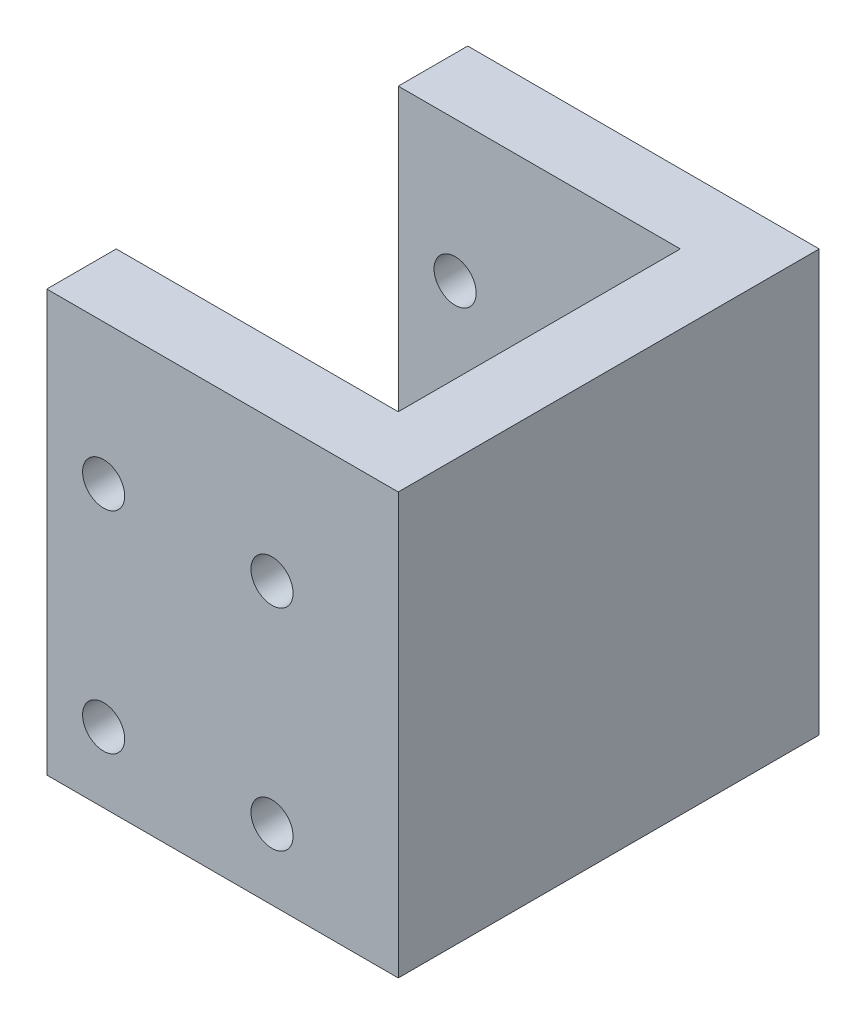
ISO-10303-21;
HEADER;
FILE_DESCRIPTION(('STEP AP214'),'2;1');
FILE_NAME('part.step','',(''),(''),'','','');
FILE_SCHEMA(('AUTOMOTIVE_DESIGN { 1 0 10303 214 1 1 1 1 }'));
ENDSEC;
DATA;
#1=APPLICATION_CONTEXT('core data for automotive mechanical design processes');
#2=APPLICATION_PROTOCOL_DEFINITION('international standard','automotive_design',2000,#1);
#3=PRODUCT_CONTEXT('',#1,'mechanical');
#4=PRODUCT('Part','Part','',(#3));
#5=PRODUCT_RELATED_PRODUCT_CATEGORY('part','',(#4));
#6=PRODUCT_DEFINITION_FORMATION('','',#4);
#7=PRODUCT_DEFINITION_CONTEXT('part definition',#1,'design');
#8=PRODUCT_DEFINITION('design','',#6,#7);
#9=PRODUCT_DEFINITION_SHAPE('','',#8);
#10=(LENGTH_UNIT() NAMED_UNIT(*) SI_UNIT(.MILLI.,.METRE.));
#11=(NAMED_UNIT(*) PLANE_ANGLE_UNIT() SI_UNIT($,.RADIAN.));
#12=(NAMED_UNIT(*) SI_UNIT($,.STERADIAN.) SOLID_ANGLE_UNIT());
#13=UNCERTAINTY_MEASURE_WITH_UNIT(LENGTH_MEASURE(1.E-05),#10,'distance_accuracy_value','');
#14=(GEOMETRIC_REPRESENTATION_CONTEXT(3) GLOBAL_UNCERTAINTY_ASSIGNED_CONTEXT((#13)) GLOBAL_UNIT_ASSIGNED_CONTEXT((#10,
#11,#12)) REPRESENTATION_CONTEXT('',''));
#15=CARTESIAN_POINT('',(0.,0.,0.));
#16=DIRECTION('',(0.,0.,1.));
#17=DIRECTION('',(1.,0.,0.));
#18=AXIS2_PLACEMENT_3D('',#15,#16,#17);
#19=CARTESIAN_POINT('',(-400.415803698117,-440.,0.));
#20=DIRECTION('',(-1.,0.,0.));
#21=DIRECTION('',(0.,0.,1.));
#22=AXIS2_PLACEMENT_3D('',#19,#20,#21);
#23=PLANE('',#22);
#24=DIRECTION('',(0.,-1.,0.));
#25=VECTOR('',#24,1.);
#26=CARTESIAN_POINT('',(-400.415803698117,-440.,-355.149999999999));
#27=LINE('',#26,#25);
#28=CARTESIAN_POINT('',(-400.415803698117,-440.,-355.149999999999));
#29=VERTEX_POINT('',#28);
#30=CARTESIAN_POINT('',(-400.415803698117,-470.,-355.149999999999));
#31=VERTEX_POINT('',#30);
#32=EDGE_CURVE('E135',#29,#31,#27,.T.);
#33=ORIENTED_EDGE('',*,*,#32,.T.);
#34=DIRECTION('',(0.,0.,-1.));
#35=VECTOR('',#34,1.);
#36=CARTESIAN_POINT('',(-400.415803698117,-470.,0.));
#37=LINE('',#36,#35);
#38=CARTESIAN_POINT('',(-400.415803698117,-470.,-350.199999999999));
#39=VERTEX_POINT('',#38);
#40=EDGE_CURVE('E166',#39,#31,#37,.T.);
#41=ORIENTED_EDGE('',*,*,#40,.F.);
#42=DIRECTION('',(0.,-1.,0.));
#43=VECTOR('',#42,1.);
#44=CARTESIAN_POINT('',(-400.415803698117,-440.,-350.199999999999));
#45=LINE('',#44,#43);
#46=CARTESIAN_POINT('',(-400.415803698117,-440.,-350.199999999999));
#47=VERTEX_POINT('',#46);
#48=EDGE_CURVE('E12',#47,#39,#45,.T.);
#49=ORIENTED_EDGE('',*,*,#48,.F.);
#50=DIRECTION('',(0.,0.,-1.));
#51=VECTOR('',#50,1.);
#52=CARTESIAN_POINT('',(-400.415803698117,-440.,0.));
#53=LINE('',#52,#51);
#54=EDGE_CURVE('E148',#47,#29,#53,.T.);
#55=ORIENTED_EDGE('',*,*,#54,.T.);
#56=EDGE_LOOP('',(#33,#41,#49,#55));
#57=FACE_BOUND('',#56,.T.);
#58=ADVANCED_FACE('F61',(#57),#23,.T.);
#59=DIRECTION('',(0.,-1.,0.));
#60=VECTOR('',#59,1.);
#61=CARTESIAN_POINT('',(-400.415803698117,-440.,-375.249999999999));
#62=LINE('',#61,#60);
#63=CARTESIAN_POINT('',(-400.415803698117,-440.,-375.249999999999));
#64=VERTEX_POINT('',#63);
#65=CARTESIAN_POINT('',(-400.415803698117,-470.,-375.249999999999));
#66=VERTEX_POINT('',#65);
#67=EDGE_CURVE('E78',#64,#66,#62,.T.);
#68=ORIENTED_EDGE('',*,*,#67,.F.);
#69=CARTESIAN_POINT('',(-400.415803698117,-440.,-380.199999999999));
#70=VERTEX_POINT('',#69);
#71=EDGE_CURVE('E110',#64,#70,#53,.T.);
#72=ORIENTED_EDGE('',*,*,#71,.T.);
#73=DIRECTION('',(0.,-1.,0.));
#74=VECTOR('',#73,1.);
#75=CARTESIAN_POINT('',(-400.415803698117,-440.,-380.199999999999));
#76=LINE('',#75,#74);
#77=CARTESIAN_POINT('',(-400.415803698117,-470.,-380.199999999999));
#78=VERTEX_POINT('',#77);
#79=EDGE_CURVE('E165',#70,#78,#76,.T.);
#80=ORIENTED_EDGE('',*,*,#79,.T.);
#81=EDGE_CURVE('E169',#66,#78,#37,.T.);
#82=ORIENTED_EDGE('',*,*,#81,.F.);
#83=EDGE_LOOP('',(#68,#72,#80,#82));
#84=FACE_BOUND('',#83,.T.);
#85=ADVANCED_FACE('F63',(#84),#23,.T.);
#86=CARTESIAN_POINT('',(0.,-440.,-350.199999999999));
#87=DIRECTION('',(0.,0.,-1.));
#88=DIRECTION('',(-1.,0.,0.));
#89=AXIS2_PLACEMENT_3D('',#86,#87,#88);
#90=PLANE('',#89);
#91=CARTESIAN_POINT('',(-396.365803698116,-465.,-350.199999999999));
#92=DIRECTION('',(0.,0.,1.));
#93=DIRECTION('',(1.,0.,0.));
#94=AXIS2_PLACEMENT_3D('',#91,#92,#93);
#95=CIRCLE('',#94,1.5000000000006);
#96=CARTESIAN_POINT('',(-394.865803698116,-465.,-350.199999999999));
#97=VERTEX_POINT('',#96);
#98=EDGE_CURVE('E402',#97,#97,#95,.T.);
#99=ORIENTED_EDGE('',*,*,#98,.F.);
#100=EDGE_LOOP('',(#99));
#101=FACE_BOUND('',#100,.T.);
#102=CARTESIAN_POINT('',(-384.365803698116,-450.,-350.199999999999));
#103=DIRECTION('',(0.,0.,1.));
#104=DIRECTION('',(1.,0.,0.));
#105=AXIS2_PLACEMENT_3D('',#102,#103,#104);
#106=CIRCLE('',#105,1.5000000000006);
#107=CARTESIAN_POINT('',(-382.865803698116,-450.,-350.199999999999));
#108=VERTEX_POINT('',#107);
#109=EDGE_CURVE('E418',#108,#108,#106,.T.);
#110=ORIENTED_EDGE('',*,*,#109,.F.);
#111=EDGE_LOOP('',(#110));
#112=FACE_BOUND('',#111,.T.);
#113=CARTESIAN_POINT('',(-396.365803698116,-450.,-350.199999999999));
#114=DIRECTION('',(0.,0.,1.));
#115=DIRECTION('',(1.,0.,0.));
#116=AXIS2_PLACEMENT_3D('',#113,#114,#115);
#117=CIRCLE('',#116,1.5000000000006);
#118=CARTESIAN_POINT('',(-394.865803698116,-450.,-350.199999999999));
#119=VERTEX_POINT('',#118);
#120=EDGE_CURVE('E436',#119,#119,#117,.T.);
#121=ORIENTED_EDGE('',*,*,#120,.F.);
#122=EDGE_LOOP('',(#121));
#123=FACE_BOUND('',#122,.T.);
#124=CARTESIAN_POINT('',(-384.365803698116,-465.,-350.199999999999));
#125=DIRECTION('',(0.,0.,1.));
#126=DIRECTION('',(1.,0.,0.));
#127=AXIS2_PLACEMENT_3D('',#124,#125,#126);
#128=CIRCLE('',#127,1.5000000000006);
#129=CARTESIAN_POINT('',(-382.865803698116,-465.,-350.199999999999));
#130=VERTEX_POINT('',#129);
#131=EDGE_CURVE('E415',#130,#130,#128,.T.);
#132=ORIENTED_EDGE('',*,*,#131,.F.);
#133=EDGE_LOOP('',(#132));
#134=FACE_BOUND('',#133,.T.);
#135=DIRECTION('',(1.,0.,0.));
#136=VECTOR('',#135,1.);
#137=CARTESIAN_POINT('',(0.,-470.,-350.199999999999));
#138=LINE('',#137,#136);
#139=CARTESIAN_POINT('',(-375.365803698117,-470.,-350.199999999999));
#140=VERTEX_POINT('',#139);
#141=EDGE_CURVE('E159',#39,#140,#138,.T.);
#142=ORIENTED_EDGE('',*,*,#141,.T.);
#143=DIRECTION('',(0.,-1.,0.));
#144=VECTOR('',#143,1.);
#145=CARTESIAN_POINT('',(-375.365803698117,-440.,-350.199999999999));
#146=LINE('',#145,#144);
#147=CARTESIAN_POINT('',(-375.365803698117,-440.,-350.199999999999));
#148=VERTEX_POINT('',#147);
#149=EDGE_CURVE('E70',#148,#140,#146,.T.);
#150=ORIENTED_EDGE('',*,*,#149,.F.);
#151=DIRECTION('',(1.,0.,0.));
#152=VECTOR('',#151,1.);
#153=CARTESIAN_POINT('',(0.,-440.,-350.199999999999));
#154=LINE('',#153,#152);
#155=EDGE_CURVE('E163',#47,#148,#154,.T.);
#156=ORIENTED_EDGE('',*,*,#155,.F.);
#157=ORIENTED_EDGE('',*,*,#48,.T.);
#158=EDGE_LOOP('',(#142,#150,#156,#157));
#159=FACE_BOUND('',#158,.T.);
#160=ADVANCED_FACE('F225',(#101,#112,#123,#134,#159),#90,.F.);
#161=CARTESIAN_POINT('',(-375.365803698117,-440.,0.));
#162=DIRECTION('',(-1.,0.,0.));
#163=DIRECTION('',(0.,0.,1.));
#164=AXIS2_PLACEMENT_3D('',#161,#162,#163);
#165=PLANE('',#164);
#166=DIRECTION('',(0.,0.,-1.));
#167=VECTOR('',#166,1.);
#168=CARTESIAN_POINT('',(-375.365803698117,-470.,0.));
#169=LINE('',#168,#167);
#170=CARTESIAN_POINT('',(-375.365803698117,-470.,-380.199999999999));
#171=VERTEX_POINT('',#170);
#172=EDGE_CURVE('E172',#140,#171,#169,.T.);
#173=ORIENTED_EDGE('',*,*,#172,.T.);
#174=DIRECTION('',(0.,-1.,0.));
#175=VECTOR('',#174,1.);
#176=CARTESIAN_POINT('',(-375.365803698117,-440.,-380.199999999999));
#177=LINE('',#176,#175);
#178=CARTESIAN_POINT('',(-375.365803698117,-440.,-380.199999999999));
#179=VERTEX_POINT('',#178);
#180=EDGE_CURVE('E178',#179,#171,#177,.T.);
#181=ORIENTED_EDGE('',*,*,#180,.F.);
#182=DIRECTION('',(0.,0.,-1.));
#183=VECTOR('',#182,1.);
#184=CARTESIAN_POINT('',(-375.365803698117,-440.,0.));
#185=LINE('',#184,#183);
#186=EDGE_CURVE('E157',#148,#179,#185,.T.);
#187=ORIENTED_EDGE('',*,*,#186,.F.);
#188=ORIENTED_EDGE('',*,*,#149,.T.);
#189=EDGE_LOOP('',(#173,#181,#187,#188));
#190=FACE_BOUND('',#189,.T.);
#191=ADVANCED_FACE('F228',(#190),#165,.F.);
#192=CARTESIAN_POINT('',(0.,-440.,-380.199999999999));
#193=DIRECTION('',(0.,0.,-1.));
#194=DIRECTION('',(-1.,0.,0.));
#195=AXIS2_PLACEMENT_3D('',#192,#193,#194);
#196=PLANE('',#195);
#197=CARTESIAN_POINT('',(-396.365803698116,-465.,-380.199999999999));
#198=DIRECTION('',(0.,0.,1.));
#199=DIRECTION('',(1.,0.,0.));
#200=AXIS2_PLACEMENT_3D('',#197,#198,#199);
#201=CIRCLE('',#200,1.5000000000006);
#202=CARTESIAN_POINT('',(-394.865803698116,-465.,-380.199999999999));
#203=VERTEX_POINT('',#202);
#204=EDGE_CURVE('E411',#203,#203,#201,.T.);
#205=ORIENTED_EDGE('',*,*,#204,.T.);
#206=EDGE_LOOP('',(#205));
#207=FACE_BOUND('',#206,.T.);
#208=CARTESIAN_POINT('',(-384.365803698116,-450.,-380.199999999999));
#209=DIRECTION('',(0.,0.,1.));
#210=DIRECTION('',(1.,0.,0.));
#211=AXIS2_PLACEMENT_3D('',#208,#209,#210);
#212=CIRCLE('',#211,1.5000000000006);
#213=CARTESIAN_POINT('',(-382.865803698116,-450.,-380.199999999999));
#214=VERTEX_POINT('',#213);
#215=EDGE_CURVE('E412',#214,#214,#212,.T.);
#216=ORIENTED_EDGE('',*,*,#215,.T.);
#217=EDGE_LOOP('',(#216));
#218=FACE_BOUND('',#217,.T.);
#219=CARTESIAN_POINT('',(-396.365803698116,-450.,-380.199999999999));
#220=DIRECTION('',(0.,0.,1.));
#221=DIRECTION('',(1.,0.,0.));
#222=AXIS2_PLACEMENT_3D('',#219,#220,#221);
#223=CIRCLE('',#222,1.5000000000006);
#224=CARTESIAN_POINT('',(-394.865803698116,-450.,-380.199999999999));
#225=VERTEX_POINT('',#224);
#226=EDGE_CURVE('E424',#225,#225,#223,.T.);
#227=ORIENTED_EDGE('',*,*,#226,.T.);
#228=EDGE_LOOP('',(#227));
#229=FACE_BOUND('',#228,.T.);
#230=CARTESIAN_POINT('',(-384.365803698116,-465.,-380.199999999999));
#231=DIRECTION('',(0.,0.,1.));
#232=DIRECTION('',(1.,0.,0.));
#233=AXIS2_PLACEMENT_3D('',#230,#231,#232);
#234=CIRCLE('',#233,1.5000000000006);
#235=CARTESIAN_POINT('',(-382.865803698116,-465.,-380.199999999999));
#236=VERTEX_POINT('',#235);
#237=EDGE_CURVE('E185',#236,#236,#234,.T.);
#238=ORIENTED_EDGE('',*,*,#237,.T.);
#239=EDGE_LOOP('',(#238));
#240=FACE_BOUND('',#239,.T.);
#241=DIRECTION('',(1.,0.,0.));
#242=VECTOR('',#241,1.);
#243=CARTESIAN_POINT('',(0.,-470.,-380.199999999999));
#244=LINE('',#243,#242);
#245=EDGE_CURVE('E168',#78,#171,#244,.T.);
#246=ORIENTED_EDGE('',*,*,#245,.F.);
#247=ORIENTED_EDGE('',*,*,#79,.F.);
#248=DIRECTION('',(1.,0.,0.));
#249=VECTOR('',#248,1.);
#250=CARTESIAN_POINT('',(0.,-440.,-380.199999999999));
#251=LINE('',#250,#249);
#252=EDGE_CURVE('E154',#70,#179,#251,.T.);
#253=ORIENTED_EDGE('',*,*,#252,.T.);
#254=ORIENTED_EDGE('',*,*,#180,.T.);
#255=EDGE_LOOP('',(#246,#247,#253,#254));
#256=FACE_BOUND('',#255,.T.);
#257=ADVANCED_FACE('F233',(#207,#218,#229,#240,#256),#196,.T.);
#258=CARTESIAN_POINT('',(0.,-440.,0.));
#259=DIRECTION('',(0.,-1.,0.));
#260=DIRECTION('',(0.,0.,-1.));
#261=AXIS2_PLACEMENT_3D('',#258,#259,#260);
#262=PLANE('',#261);
#263=DIRECTION('',(0.,0.,1.));
#264=VECTOR('',#263,1.);
#265=CARTESIAN_POINT('',(-380.315803698117,-440.,-375.249999999999));
#266=LINE('',#265,#264);
#267=CARTESIAN_POINT('',(-380.315803698117,-440.,-375.249999999999));
#268=VERTEX_POINT('',#267);
#269=CARTESIAN_POINT('',(-380.315803698117,-440.,-355.149999999999));
#270=VERTEX_POINT('',#269);
#271=EDGE_CURVE('E143',#268,#270,#266,.T.);
#272=ORIENTED_EDGE('',*,*,#271,.T.);
#273=DIRECTION('',(-1.,0.,0.));
#274=VECTOR('',#273,1.);
#275=CARTESIAN_POINT('',(-380.315803698117,-440.,-355.149999999999));
#276=LINE('',#275,#274);
#277=EDGE_CURVE('E138',#270,#29,#276,.T.);
#278=ORIENTED_EDGE('',*,*,#277,.T.);
#279=ORIENTED_EDGE('',*,*,#54,.F.);
#280=ORIENTED_EDGE('',*,*,#155,.T.);
#281=ORIENTED_EDGE('',*,*,#186,.T.);
#282=ORIENTED_EDGE('',*,*,#252,.F.);
#283=ORIENTED_EDGE('',*,*,#71,.F.);
#284=DIRECTION('',(1.,0.,0.));
#285=VECTOR('',#284,1.);
#286=CARTESIAN_POINT('',(-400.415803698117,-440.,-375.249999999999));
#287=LINE('',#286,#285);
#288=EDGE_CURVE('E151',#64,#268,#287,.T.);
#289=ORIENTED_EDGE('',*,*,#288,.T.);
#290=EDGE_LOOP('',(#272,#278,#279,#280,#281,#282,#283,#289));
#291=FACE_BOUND('',#290,.T.);
#292=ADVANCED_FACE('F147',(#291),#262,.F.);
#293=CARTESIAN_POINT('',(0.,-470.,0.));
#294=DIRECTION('',(0.,-1.,0.));
#295=DIRECTION('',(0.,0.,-1.));
#296=AXIS2_PLACEMENT_3D('',#293,#294,#295);
#297=PLANE('',#296);
#298=DIRECTION('',(-1.,0.,0.));
#299=VECTOR('',#298,1.);
#300=CARTESIAN_POINT('',(-380.315803698117,-470.,-355.149999999999));
#301=LINE('',#300,#299);
#302=CARTESIAN_POINT('',(-380.315803698117,-470.,-355.149999999999));
#303=VERTEX_POINT('',#302);
#304=EDGE_CURVE('E141',#303,#31,#301,.T.);
#305=ORIENTED_EDGE('',*,*,#304,.F.);
#306=DIRECTION('',(0.,0.,1.));
#307=VECTOR('',#306,1.);
#308=CARTESIAN_POINT('',(-380.315803698117,-470.,-375.249999999999));
#309=LINE('',#308,#307);
#310=CARTESIAN_POINT('',(-380.315803698117,-470.,-375.249999999999));
#311=VERTEX_POINT('',#310);
#312=EDGE_CURVE('E152',#311,#303,#309,.T.);
#313=ORIENTED_EDGE('',*,*,#312,.F.);
#314=DIRECTION('',(1.,0.,0.));
#315=VECTOR('',#314,1.);
#316=CARTESIAN_POINT('',(-400.415803698117,-470.,-375.249999999999));
#317=LINE('',#316,#315);
#318=EDGE_CURVE('E209',#66,#311,#317,.T.);
#319=ORIENTED_EDGE('',*,*,#318,.F.);
#320=ORIENTED_EDGE('',*,*,#81,.T.);
#321=ORIENTED_EDGE('',*,*,#245,.T.);
#322=ORIENTED_EDGE('',*,*,#172,.F.);
#323=ORIENTED_EDGE('',*,*,#141,.F.);
#324=ORIENTED_EDGE('',*,*,#40,.T.);
#325=EDGE_LOOP('',(#305,#313,#319,#320,#321,#322,#323,#324));
#326=FACE_BOUND('',#325,.T.);
#327=ADVANCED_FACE('F222',(#326),#297,.T.);
#328=CARTESIAN_POINT('',(-380.315803698117,-440.,-355.149999999999));
#329=DIRECTION('',(0.,0.,1.));
#330=DIRECTION('',(1.,0.,0.));
#331=AXIS2_PLACEMENT_3D('',#328,#329,#330);
#332=PLANE('',#331);
#333=CARTESIAN_POINT('',(-396.365803698116,-465.,-355.149999999999));
#334=DIRECTION('',(0.,0.,1.));
#335=DIRECTION('',(1.,0.,0.));
#336=AXIS2_PLACEMENT_3D('',#333,#334,#335);
#337=CIRCLE('',#336,1.5000000000006);
#338=CARTESIAN_POINT('',(-394.865803698116,-465.,-355.149999999999));
#339=VERTEX_POINT('',#338);
#340=EDGE_CURVE('E203',#339,#339,#337,.T.);
#341=ORIENTED_EDGE('',*,*,#340,.T.);
#342=EDGE_LOOP('',(#341));
#343=FACE_BOUND('',#342,.T.);
#344=CARTESIAN_POINT('',(-384.365803698116,-450.,-355.149999999999));
#345=DIRECTION('',(0.,0.,1.));
#346=DIRECTION('',(1.,0.,0.));
#347=AXIS2_PLACEMENT_3D('',#344,#345,#346);
#348=CIRCLE('',#347,1.5000000000006);
#349=CARTESIAN_POINT('',(-382.865803698116,-450.,-355.149999999999));
#350=VERTEX_POINT('',#349);
#351=EDGE_CURVE('E191',#350,#350,#348,.T.);
#352=ORIENTED_EDGE('',*,*,#351,.T.);
#353=EDGE_LOOP('',(#352));
#354=FACE_BOUND('',#353,.T.);
#355=CARTESIAN_POINT('',(-396.365803698116,-450.,-355.149999999999));
#356=DIRECTION('',(0.,0.,1.));
#357=DIRECTION('',(1.,0.,0.));
#358=AXIS2_PLACEMENT_3D('',#355,#356,#357);
#359=CIRCLE('',#358,1.5000000000006);
#360=CARTESIAN_POINT('',(-394.865803698116,-450.,-355.149999999999));
#361=VERTEX_POINT('',#360);
#362=EDGE_CURVE('E188',#361,#361,#359,.T.);
#363=ORIENTED_EDGE('',*,*,#362,.T.);
#364=EDGE_LOOP('',(#363));
#365=FACE_BOUND('',#364,.T.);
#366=CARTESIAN_POINT('',(-384.365803698116,-465.,-355.149999999999));
#367=DIRECTION('',(0.,0.,1.));
#368=DIRECTION('',(1.,0.,0.));
#369=AXIS2_PLACEMENT_3D('',#366,#367,#368);
#370=CIRCLE('',#369,1.5000000000006);
#371=CARTESIAN_POINT('',(-382.865803698116,-465.,-355.149999999999));
#372=VERTEX_POINT('',#371);
#373=EDGE_CURVE('E184',#372,#372,#370,.T.);
#374=ORIENTED_EDGE('',*,*,#373,.T.);
#375=EDGE_LOOP('',(#374));
#376=FACE_BOUND('',#375,.T.);
#377=ORIENTED_EDGE('',*,*,#304,.T.);
#378=ORIENTED_EDGE('',*,*,#32,.F.);
#379=ORIENTED_EDGE('',*,*,#277,.F.);
#380=DIRECTION('',(0.,-1.,0.));
#381=VECTOR('',#380,1.);
#382=CARTESIAN_POINT('',(-380.315803698117,-440.,-355.149999999999));
#383=LINE('',#382,#381);
#384=EDGE_CURVE('E213',#270,#303,#383,.T.);
#385=ORIENTED_EDGE('',*,*,#384,.T.);
#386=EDGE_LOOP('',(#377,#378,#379,#385));
#387=FACE_BOUND('',#386,.T.);
#388=ADVANCED_FACE('F137',(#343,#354,#365,#376,#387),#332,.F.);
#389=CARTESIAN_POINT('',(-380.315803698117,-440.,-375.249999999999));
#390=DIRECTION('',(1.,0.,0.));
#391=DIRECTION('',(0.,0.,-1.));
#392=AXIS2_PLACEMENT_3D('',#389,#390,#391);
#393=PLANE('',#392);
#394=ORIENTED_EDGE('',*,*,#312,.T.);
#395=ORIENTED_EDGE('',*,*,#384,.F.);
#396=ORIENTED_EDGE('',*,*,#271,.F.);
#397=DIRECTION('',(0.,-1.,0.));
#398=VECTOR('',#397,1.);
#399=CARTESIAN_POINT('',(-380.315803698117,-440.,-375.249999999999));
#400=LINE('',#399,#398);
#401=EDGE_CURVE('E215',#268,#311,#400,.T.);
#402=ORIENTED_EDGE('',*,*,#401,.T.);
#403=EDGE_LOOP('',(#394,#395,#396,#402));
#404=FACE_BOUND('',#403,.T.);
#405=ADVANCED_FACE('F217',(#404),#393,.F.);
#406=CARTESIAN_POINT('',(-400.415803698117,-440.,-375.249999999999));
#407=DIRECTION('',(0.,0.,-1.));
#408=DIRECTION('',(-1.,0.,0.));
#409=AXIS2_PLACEMENT_3D('',#406,#407,#408);
#410=PLANE('',#409);
#411=CARTESIAN_POINT('',(-396.365803698116,-465.,-375.249999999999));
#412=DIRECTION('',(0.,0.,-1.));
#413=DIRECTION('',(-1.,0.,0.));
#414=AXIS2_PLACEMENT_3D('',#411,#412,#413);
#415=CIRCLE('',#414,1.5000000000006);
#416=CARTESIAN_POINT('',(-397.865803698117,-465.,-375.249999999999));
#417=VERTEX_POINT('',#416);
#418=EDGE_CURVE('E65',#417,#417,#415,.T.);
#419=ORIENTED_EDGE('',*,*,#418,.T.);
#420=EDGE_LOOP('',(#419));
#421=FACE_BOUND('',#420,.T.);
#422=CARTESIAN_POINT('',(-384.365803698116,-450.,-375.249999999999));
#423=DIRECTION('',(0.,0.,-1.));
#424=DIRECTION('',(-1.,0.,0.));
#425=AXIS2_PLACEMENT_3D('',#422,#423,#424);
#426=CIRCLE('',#425,1.5000000000006);
#427=CARTESIAN_POINT('',(-385.865803698117,-450.,-375.249999999999));
#428=VERTEX_POINT('',#427);
#429=EDGE_CURVE('E189',#428,#428,#426,.T.);
#430=ORIENTED_EDGE('',*,*,#429,.T.);
#431=EDGE_LOOP('',(#430));
#432=FACE_BOUND('',#431,.T.);
#433=CARTESIAN_POINT('',(-396.365803698116,-450.,-375.249999999999));
#434=DIRECTION('',(0.,0.,-1.));
#435=DIRECTION('',(-1.,0.,0.));
#436=AXIS2_PLACEMENT_3D('',#433,#434,#435);
#437=CIRCLE('',#436,1.5000000000006);
#438=CARTESIAN_POINT('',(-397.865803698117,-450.,-375.249999999999));
#439=VERTEX_POINT('',#438);
#440=EDGE_CURVE('E186',#439,#439,#437,.T.);
#441=ORIENTED_EDGE('',*,*,#440,.T.);
#442=EDGE_LOOP('',(#441));
#443=FACE_BOUND('',#442,.T.);
#444=CARTESIAN_POINT('',(-384.365803698116,-465.,-375.249999999999));
#445=DIRECTION('',(0.,0.,-1.));
#446=DIRECTION('',(-1.,0.,0.));
#447=AXIS2_PLACEMENT_3D('',#444,#445,#446);
#448=CIRCLE('',#447,1.5000000000006);
#449=CARTESIAN_POINT('',(-385.865803698117,-465.,-375.249999999999));
#450=VERTEX_POINT('',#449);
#451=EDGE_CURVE('E181',#450,#450,#448,.T.);
#452=ORIENTED_EDGE('',*,*,#451,.T.);
#453=EDGE_LOOP('',(#452));
#454=FACE_BOUND('',#453,.T.);
#455=ORIENTED_EDGE('',*,*,#318,.T.);
#456=ORIENTED_EDGE('',*,*,#401,.F.);
#457=ORIENTED_EDGE('',*,*,#288,.F.);
#458=ORIENTED_EDGE('',*,*,#67,.T.);
#459=EDGE_LOOP('',(#455,#456,#457,#458));
#460=FACE_BOUND('',#459,.T.);
#461=ADVANCED_FACE('F219',(#421,#432,#443,#454,#460),#410,.F.);
#462=CARTESIAN_POINT('',(-384.365803698116,-465.,-380.199999999999));
#463=DIRECTION('',(0.,0.,1.));
#464=DIRECTION('',(1.,0.,0.));
#465=AXIS2_PLACEMENT_3D('',#462,#463,#464);
#466=CYLINDRICAL_SURFACE('',#465,1.5000000000006);
#467=ORIENTED_EDGE('',*,*,#237,.F.);
#468=EDGE_LOOP('',(#467));
#469=FACE_BOUND('',#468,.T.);
#470=ORIENTED_EDGE('',*,*,#451,.F.);
#471=EDGE_LOOP('',(#470));
#472=FACE_BOUND('',#471,.T.);
#473=ADVANCED_FACE('F319',(#469,#472),#466,.F.);
#474=CARTESIAN_POINT('',(-396.365803698116,-450.,-380.199999999999));
#475=DIRECTION('',(0.,0.,1.));
#476=DIRECTION('',(1.,0.,0.));
#477=AXIS2_PLACEMENT_3D('',#474,#475,#476);
#478=CYLINDRICAL_SURFACE('',#477,1.5000000000006);
#479=ORIENTED_EDGE('',*,*,#226,.F.);
#480=EDGE_LOOP('',(#479));
#481=FACE_BOUND('',#480,.T.);
#482=ORIENTED_EDGE('',*,*,#440,.F.);
#483=EDGE_LOOP('',(#482));
#484=FACE_BOUND('',#483,.T.);
#485=ADVANCED_FACE('F329',(#481,#484),#478,.F.);
#486=CARTESIAN_POINT('',(-384.365803698116,-450.,-380.199999999999));
#487=DIRECTION('',(0.,0.,1.));
#488=DIRECTION('',(1.,0.,0.));
#489=AXIS2_PLACEMENT_3D('',#486,#487,#488);
#490=CYLINDRICAL_SURFACE('',#489,1.5000000000006);
#491=ORIENTED_EDGE('',*,*,#215,.F.);
#492=EDGE_LOOP('',(#491));
#493=FACE_BOUND('',#492,.T.);
#494=ORIENTED_EDGE('',*,*,#429,.F.);
#495=EDGE_LOOP('',(#494));
#496=FACE_BOUND('',#495,.T.);
#497=ADVANCED_FACE('F340',(#493,#496),#490,.F.);
#498=CARTESIAN_POINT('',(-396.365803698116,-465.,-380.199999999999));
#499=DIRECTION('',(0.,0.,1.));
#500=DIRECTION('',(1.,0.,0.));
#501=AXIS2_PLACEMENT_3D('',#498,#499,#500);
#502=CYLINDRICAL_SURFACE('',#501,1.5000000000006);
#503=ORIENTED_EDGE('',*,*,#204,.F.);
#504=EDGE_LOOP('',(#503));
#505=FACE_BOUND('',#504,.T.);
#506=ORIENTED_EDGE('',*,*,#418,.F.);
#507=EDGE_LOOP('',(#506));
#508=FACE_BOUND('',#507,.T.);
#509=ADVANCED_FACE('F351',(#505,#508),#502,.F.);
#510=ORIENTED_EDGE('',*,*,#131,.T.);
#511=EDGE_LOOP('',(#510));
#512=FACE_BOUND('',#511,.T.);
#513=ORIENTED_EDGE('',*,*,#373,.F.);
#514=EDGE_LOOP('',(#513));
#515=FACE_BOUND('',#514,.T.);
#516=ADVANCED_FACE('F332',(#512,#515),#466,.F.);
#517=ORIENTED_EDGE('',*,*,#120,.T.);
#518=EDGE_LOOP('',(#517));
#519=FACE_BOUND('',#518,.T.);
#520=ORIENTED_EDGE('',*,*,#362,.F.);
#521=EDGE_LOOP('',(#520));
#522=FACE_BOUND('',#521,.T.);
#523=ADVANCED_FACE('F343',(#519,#522),#478,.F.);
#524=ORIENTED_EDGE('',*,*,#109,.T.);
#525=EDGE_LOOP('',(#524));
#526=FACE_BOUND('',#525,.T.);
#527=ORIENTED_EDGE('',*,*,#351,.F.);
#528=EDGE_LOOP('',(#527));
#529=FACE_BOUND('',#528,.T.);
#530=ADVANCED_FACE('F354',(#526,#529),#490,.F.);
#531=ORIENTED_EDGE('',*,*,#98,.T.);
#532=EDGE_LOOP('',(#531));
#533=FACE_BOUND('',#532,.T.);
#534=ORIENTED_EDGE('',*,*,#340,.F.);
#535=EDGE_LOOP('',(#534));
#536=FACE_BOUND('',#535,.T.);
#537=ADVANCED_FACE('F364',(#533,#536),#502,.F.);
#538=CLOSED_SHELL('',(#58,#85,#160,#191,#257,#292,#327,#388,#405,#461,#473,#485,#497,#509,#516,
#523,#530,#537));
#539=MANIFOLD_SOLID_BREP('B2',#538);
#540=ADVANCED_BREP_SHAPE_REPRESENTATION('',(#18,#539),#14);
#541=SHAPE_DEFINITION_REPRESENTATION(#9,#540);
ENDSEC;
END-ISO-10303-21;
